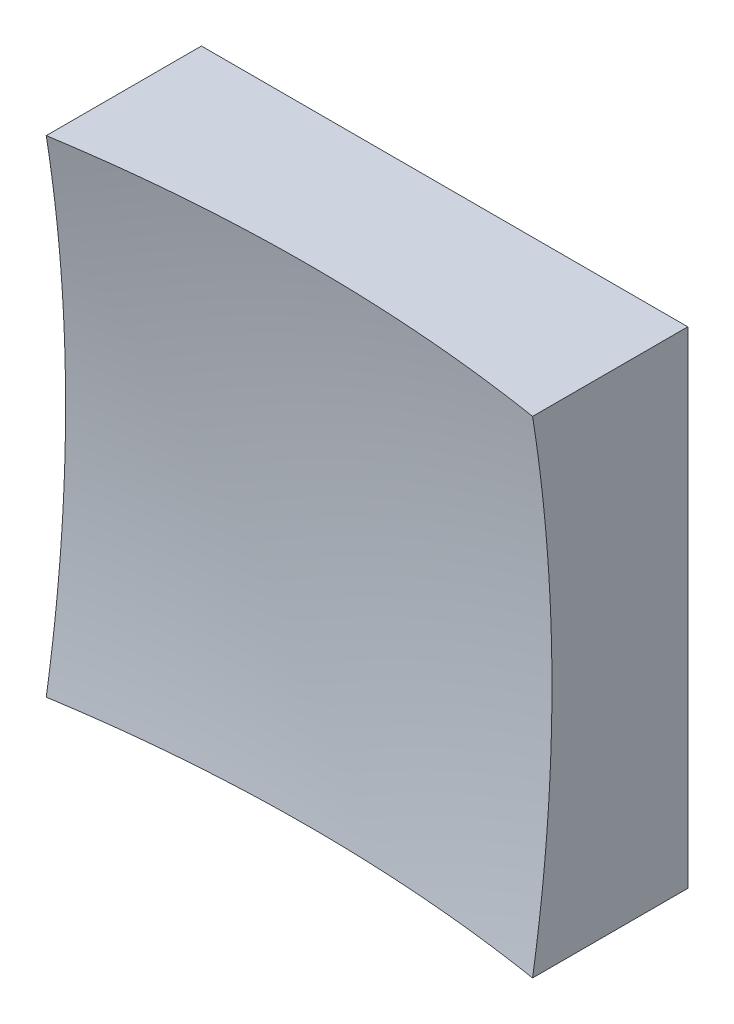
ISO-10303-21;
HEADER;
FILE_DESCRIPTION(('STEP AP214'),'2;1');
FILE_NAME('part.step','',(''),(''),'','','');
FILE_SCHEMA(('AUTOMOTIVE_DESIGN { 1 0 10303 214 1 1 1 1 }'));
ENDSEC;
DATA;
#1=APPLICATION_CONTEXT('core data for automotive mechanical design processes');
#2=APPLICATION_PROTOCOL_DEFINITION('international standard','automotive_design',2000,#1);
#3=PRODUCT_CONTEXT('',#1,'mechanical');
#4=PRODUCT('Part','Part','',(#3));
#5=PRODUCT_RELATED_PRODUCT_CATEGORY('part','',(#4));
#6=PRODUCT_DEFINITION_FORMATION('','',#4);
#7=PRODUCT_DEFINITION_CONTEXT('part definition',#1,'design');
#8=PRODUCT_DEFINITION('design','',#6,#7);
#9=PRODUCT_DEFINITION_SHAPE('','',#8);
#10=(LENGTH_UNIT() NAMED_UNIT(*) SI_UNIT(.MILLI.,.METRE.));
#11=(NAMED_UNIT(*) PLANE_ANGLE_UNIT() SI_UNIT($,.RADIAN.));
#12=(NAMED_UNIT(*) SI_UNIT($,.STERADIAN.) SOLID_ANGLE_UNIT());
#13=UNCERTAINTY_MEASURE_WITH_UNIT(LENGTH_MEASURE(1.E-05),#10,'distance_accuracy_value','');
#14=(GEOMETRIC_REPRESENTATION_CONTEXT(3) GLOBAL_UNCERTAINTY_ASSIGNED_CONTEXT((#13)) GLOBAL_UNIT_ASSIGNED_CONTEXT((#10,
#11,#12)) REPRESENTATION_CONTEXT('',''));
#15=CARTESIAN_POINT('',(0.,0.,0.));
#16=DIRECTION('',(0.,0.,1.));
#17=DIRECTION('',(1.,0.,0.));
#18=AXIS2_PLACEMENT_3D('',#15,#16,#17);
#19=CARTESIAN_POINT('',(-6.25,6.25,10.));
#20=DIRECTION('',(0.,1.,0.));
#21=DIRECTION('',(0.,0.,1.));
#22=AXIS2_PLACEMENT_3D('',#19,#20,#21);
#23=PLANE('',#22);
#24=CARTESIAN_POINT('',(0.,6.25,43.));
#25=DIRECTION('',(0.,1.,0.));
#26=DIRECTION('',(0.,0.,1.));
#27=AXIS2_PLACEMENT_3D('',#24,#25,#26);
#28=CIRCLE('',#27,39.5087015731978);
#29=CARTESIAN_POINT('',(6.25,6.25,3.98878366418191));
#30=VERTEX_POINT('',#29);
#31=CARTESIAN_POINT('',(-6.25,6.25,3.98878366418191));
#32=VERTEX_POINT('',#31);
#33=EDGE_CURVE('E79',#30,#32,#28,.T.);
#34=ORIENTED_EDGE('',*,*,#33,.F.);
#35=DIRECTION('',(0.,0.,-1.));
#36=VECTOR('',#35,1.);
#37=CARTESIAN_POINT('',(6.25,6.25,10.));
#38=LINE('',#37,#36);
#39=CARTESIAN_POINT('',(6.25,6.25,0.));
#40=VERTEX_POINT('',#39);
#41=EDGE_CURVE('E85',#30,#40,#38,.T.);
#42=ORIENTED_EDGE('',*,*,#41,.T.);
#43=DIRECTION('',(1.,0.,0.));
#44=VECTOR('',#43,1.);
#45=CARTESIAN_POINT('',(-6.25,6.25,0.));
#46=LINE('',#45,#44);
#47=CARTESIAN_POINT('',(-6.25,6.25,0.));
#48=VERTEX_POINT('',#47);
#49=EDGE_CURVE('E88',#48,#40,#46,.T.);
#50=ORIENTED_EDGE('',*,*,#49,.F.);
#51=DIRECTION('',(0.,0.,-1.));
#52=VECTOR('',#51,1.);
#53=CARTESIAN_POINT('',(-6.25,6.25,10.));
#54=LINE('',#53,#52);
#55=EDGE_CURVE('E47',#32,#48,#54,.T.);
#56=ORIENTED_EDGE('',*,*,#55,.F.);
#57=EDGE_LOOP('',(#34,#42,#50,#56));
#58=FACE_BOUND('',#57,.T.);
#59=ADVANCED_FACE('F39',(#58),#23,.T.);
#60=CARTESIAN_POINT('',(-6.25,6.25,10.));
#61=DIRECTION('',(1.,0.,0.));
#62=DIRECTION('',(0.,0.,-1.));
#63=AXIS2_PLACEMENT_3D('',#60,#61,#62);
#64=PLANE('',#63);
#65=DIRECTION('',(0.,0.,-1.));
#66=VECTOR('',#65,1.);
#67=CARTESIAN_POINT('',(-6.25,-6.25,10.));
#68=LINE('',#67,#66);
#69=CARTESIAN_POINT('',(-6.25,-6.25,3.98878366418191));
#70=VERTEX_POINT('',#69);
#71=CARTESIAN_POINT('',(-6.25,-6.25,0.));
#72=VERTEX_POINT('',#71);
#73=EDGE_CURVE('E100',#70,#72,#68,.T.);
#74=ORIENTED_EDGE('',*,*,#73,.F.);
#75=CARTESIAN_POINT('',(-6.25,0.,43.));
#76=DIRECTION('',(1.,0.,0.));
#77=DIRECTION('',(0.,0.,-1.));
#78=AXIS2_PLACEMENT_3D('',#75,#76,#77);
#79=CIRCLE('',#78,39.5087015731978);
#80=EDGE_CURVE('E89',#70,#32,#79,.T.);
#81=ORIENTED_EDGE('',*,*,#80,.T.);
#82=ORIENTED_EDGE('',*,*,#55,.T.);
#83=DIRECTION('',(0.,-1.,0.));
#84=VECTOR('',#83,1.);
#85=CARTESIAN_POINT('',(-6.25,6.25,0.));
#86=LINE('',#85,#84);
#87=EDGE_CURVE('E97',#48,#72,#86,.T.);
#88=ORIENTED_EDGE('',*,*,#87,.T.);
#89=EDGE_LOOP('',(#74,#81,#82,#88));
#90=FACE_BOUND('',#89,.T.);
#91=ADVANCED_FACE('F122',(#90),#64,.F.);
#92=CARTESIAN_POINT('',(-6.25,-6.25,10.));
#93=DIRECTION('',(0.,1.,0.));
#94=DIRECTION('',(0.,0.,1.));
#95=AXIS2_PLACEMENT_3D('',#92,#93,#94);
#96=PLANE('',#95);
#97=DIRECTION('',(0.,0.,-1.));
#98=VECTOR('',#97,1.);
#99=CARTESIAN_POINT('',(6.25,-6.25,10.));
#100=LINE('',#99,#98);
#101=CARTESIAN_POINT('',(6.25,-6.25,3.98878366418191));
#102=VERTEX_POINT('',#101);
#103=CARTESIAN_POINT('',(6.25,-6.25,0.));
#104=VERTEX_POINT('',#103);
#105=EDGE_CURVE('E96',#102,#104,#100,.T.);
#106=ORIENTED_EDGE('',*,*,#105,.F.);
#107=CARTESIAN_POINT('',(0.,-6.25,43.));
#108=DIRECTION('',(0.,1.,0.));
#109=DIRECTION('',(0.,0.,1.));
#110=AXIS2_PLACEMENT_3D('',#107,#108,#109);
#111=CIRCLE('',#110,39.5087015731978);
#112=EDGE_CURVE('E53',#102,#70,#111,.T.);
#113=ORIENTED_EDGE('',*,*,#112,.T.);
#114=ORIENTED_EDGE('',*,*,#73,.T.);
#115=DIRECTION('',(1.,0.,0.));
#116=VECTOR('',#115,1.);
#117=CARTESIAN_POINT('',(-6.25,-6.25,0.));
#118=LINE('',#117,#116);
#119=EDGE_CURVE('E102',#72,#104,#118,.T.);
#120=ORIENTED_EDGE('',*,*,#119,.T.);
#121=EDGE_LOOP('',(#106,#113,#114,#120));
#122=FACE_BOUND('',#121,.T.);
#123=ADVANCED_FACE('F121',(#122),#96,.F.);
#124=CARTESIAN_POINT('',(6.25,6.25,10.));
#125=DIRECTION('',(1.,0.,0.));
#126=DIRECTION('',(0.,0.,-1.));
#127=AXIS2_PLACEMENT_3D('',#124,#125,#126);
#128=PLANE('',#127);
#129=CARTESIAN_POINT('',(6.25,0.,43.));
#130=DIRECTION('',(1.,0.,0.));
#131=DIRECTION('',(0.,0.,-1.));
#132=AXIS2_PLACEMENT_3D('',#129,#130,#131);
#133=CIRCLE('',#132,39.5087015731978);
#134=EDGE_CURVE('E11',#102,#30,#133,.T.);
#135=ORIENTED_EDGE('',*,*,#134,.F.);
#136=ORIENTED_EDGE('',*,*,#105,.T.);
#137=DIRECTION('',(0.,-1.,0.));
#138=VECTOR('',#137,1.);
#139=CARTESIAN_POINT('',(6.25,6.25,0.));
#140=LINE('',#139,#138);
#141=EDGE_CURVE('E93',#40,#104,#140,.T.);
#142=ORIENTED_EDGE('',*,*,#141,.F.);
#143=ORIENTED_EDGE('',*,*,#41,.F.);
#144=EDGE_LOOP('',(#135,#136,#142,#143));
#145=FACE_BOUND('',#144,.T.);
#146=ADVANCED_FACE('F91',(#145),#128,.T.);
#147=CARTESIAN_POINT('',(0.,0.,0.));
#148=DIRECTION('',(0.,0.,-1.));
#149=DIRECTION('',(-1.,0.,0.));
#150=AXIS2_PLACEMENT_3D('',#147,#148,#149);
#151=PLANE('',#150);
#152=ORIENTED_EDGE('',*,*,#49,.T.);
#153=ORIENTED_EDGE('',*,*,#141,.T.);
#154=ORIENTED_EDGE('',*,*,#119,.F.);
#155=ORIENTED_EDGE('',*,*,#87,.F.);
#156=EDGE_LOOP('',(#152,#153,#154,#155));
#157=FACE_BOUND('',#156,.T.);
#158=ADVANCED_FACE('F125',(#157),#151,.T.);
#159=CARTESIAN_POINT('',(0.,0.,43.));
#160=DIRECTION('',(0.,0.,1.));
#161=DIRECTION('',(1.,0.,0.));
#162=AXIS2_PLACEMENT_3D('',#159,#160,#161);
#163=SPHERICAL_SURFACE('',#162,40.);
#164=ORIENTED_EDGE('',*,*,#33,.T.);
#165=ORIENTED_EDGE('',*,*,#80,.F.);
#166=ORIENTED_EDGE('',*,*,#112,.F.);
#167=ORIENTED_EDGE('',*,*,#134,.T.);
#168=EDGE_LOOP('',(#164,#165,#166,#167));
#169=FACE_BOUND('',#168,.T.);
#170=ADVANCED_FACE('F78',(#169),#163,.F.);
#171=CLOSED_SHELL('',(#59,#91,#123,#146,#158,#170));
#172=MANIFOLD_SOLID_BREP('B2',#171);
#173=ADVANCED_BREP_SHAPE_REPRESENTATION('',(#18,#172),#14);
#174=SHAPE_DEFINITION_REPRESENTATION(#9,#173);
ENDSEC;
END-ISO-10303-21;
